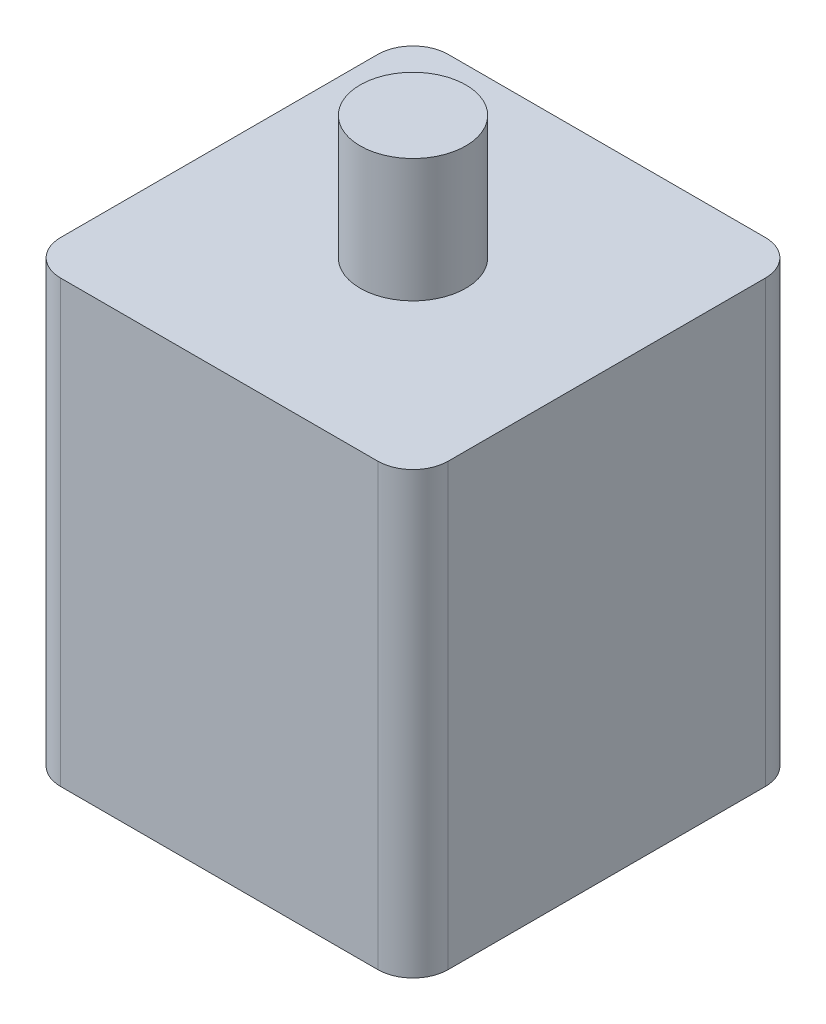
ISO-10303-21;
HEADER;
FILE_DESCRIPTION(('STEP AP214'),'2;1');
FILE_NAME('part.step','',(''),(''),'','','');
FILE_SCHEMA(('AUTOMOTIVE_DESIGN { 1 0 10303 214 1 1 1 1 }'));
ENDSEC;
DATA;
#1=APPLICATION_CONTEXT('core data for automotive mechanical design processes');
#2=APPLICATION_PROTOCOL_DEFINITION('international standard','automotive_design',2000,#1);
#3=PRODUCT_CONTEXT('',#1,'mechanical');
#4=PRODUCT('Part','Part','',(#3));
#5=PRODUCT_RELATED_PRODUCT_CATEGORY('part','',(#4));
#6=PRODUCT_DEFINITION_FORMATION('','',#4);
#7=PRODUCT_DEFINITION_CONTEXT('part definition',#1,'design');
#8=PRODUCT_DEFINITION('design','',#6,#7);
#9=PRODUCT_DEFINITION_SHAPE('','',#8);
#10=(LENGTH_UNIT() NAMED_UNIT(*) SI_UNIT(.MILLI.,.METRE.));
#11=(NAMED_UNIT(*) PLANE_ANGLE_UNIT() SI_UNIT($,.RADIAN.));
#12=(NAMED_UNIT(*) SI_UNIT($,.STERADIAN.) SOLID_ANGLE_UNIT());
#13=UNCERTAINTY_MEASURE_WITH_UNIT(LENGTH_MEASURE(1.E-05),#10,'distance_accuracy_value','');
#14=(GEOMETRIC_REPRESENTATION_CONTEXT(3) GLOBAL_UNCERTAINTY_ASSIGNED_CONTEXT((#13)) GLOBAL_UNIT_ASSIGNED_CONTEXT((#10,
#11,#12)) REPRESENTATION_CONTEXT('',''));
#15=CARTESIAN_POINT('',(0.,0.,0.));
#16=DIRECTION('',(0.,0.,1.));
#17=DIRECTION('',(1.,0.,0.));
#18=AXIS2_PLACEMENT_3D('',#15,#16,#17);
#19=CARTESIAN_POINT('',(-9.,25.,-9.));
#20=DIRECTION('',(0.,-1.,0.));
#21=DIRECTION('',(0.,0.,-1.));
#22=AXIS2_PLACEMENT_3D('',#19,#20,#21);
#23=CYLINDRICAL_SURFACE('',#22,2.);
#24=CARTESIAN_POINT('',(-9.,0.,-9.));
#25=DIRECTION('',(0.,1.,0.));
#26=DIRECTION('',(0.,0.,1.));
#27=AXIS2_PLACEMENT_3D('',#24,#25,#26);
#28=CIRCLE('',#27,2.);
#29=CARTESIAN_POINT('',(-11.,0.,-8.99999999999999));
#30=VERTEX_POINT('',#29);
#31=CARTESIAN_POINT('',(-8.99999999999999,0.,-11.));
#32=VERTEX_POINT('',#31);
#33=EDGE_CURVE('E129',#30,#32,#28,.F.);
#34=ORIENTED_EDGE('',*,*,#33,.F.);
#35=DIRECTION('',(0.,-1.,0.));
#36=VECTOR('',#35,1.);
#37=CARTESIAN_POINT('',(-11.,25.,-8.99999999999999));
#38=LINE('',#37,#36);
#39=CARTESIAN_POINT('',(-11.,25.,-8.99999999999999));
#40=VERTEX_POINT('',#39);
#41=EDGE_CURVE('E37',#40,#30,#38,.T.);
#42=ORIENTED_EDGE('',*,*,#41,.F.);
#43=CARTESIAN_POINT('',(-9.,25.,-9.));
#44=DIRECTION('',(0.,1.,0.));
#45=DIRECTION('',(0.,0.,1.));
#46=AXIS2_PLACEMENT_3D('',#43,#44,#45);
#47=CIRCLE('',#46,2.);
#48=CARTESIAN_POINT('',(-8.99999999999999,25.,-11.));
#49=VERTEX_POINT('',#48);
#50=EDGE_CURVE('E148',#40,#49,#47,.F.);
#51=ORIENTED_EDGE('',*,*,#50,.T.);
#52=DIRECTION('',(0.,-1.,0.));
#53=VECTOR('',#52,1.);
#54=CARTESIAN_POINT('',(-8.99999999999999,25.,-11.));
#55=LINE('',#54,#53);
#56=EDGE_CURVE('E51',#49,#32,#55,.T.);
#57=ORIENTED_EDGE('',*,*,#56,.T.);
#58=EDGE_LOOP('',(#34,#42,#51,#57));
#59=FACE_BOUND('',#58,.T.);
#60=ADVANCED_FACE('F34',(#59),#23,.T.);
#61=CARTESIAN_POINT('',(-11.,25.,0.));
#62=DIRECTION('',(-1.,0.,0.));
#63=DIRECTION('',(0.,0.,1.));
#64=AXIS2_PLACEMENT_3D('',#61,#62,#63);
#65=PLANE('',#64);
#66=DIRECTION('',(0.,0.,-1.));
#67=VECTOR('',#66,1.);
#68=CARTESIAN_POINT('',(-11.,0.,0.));
#69=LINE('',#68,#67);
#70=CARTESIAN_POINT('',(-11.,0.,8.99999999999998));
#71=VERTEX_POINT('',#70);
#72=EDGE_CURVE('E131',#71,#30,#69,.T.);
#73=ORIENTED_EDGE('',*,*,#72,.F.);
#74=DIRECTION('',(0.,-1.,0.));
#75=VECTOR('',#74,1.);
#76=CARTESIAN_POINT('',(-11.,25.,8.99999999999998));
#77=LINE('',#76,#75);
#78=CARTESIAN_POINT('',(-11.,25.,8.99999999999998));
#79=VERTEX_POINT('',#78);
#80=EDGE_CURVE('E156',#79,#71,#77,.T.);
#81=ORIENTED_EDGE('',*,*,#80,.F.);
#82=DIRECTION('',(0.,0.,-1.));
#83=VECTOR('',#82,1.);
#84=CARTESIAN_POINT('',(-11.,25.,0.));
#85=LINE('',#84,#83);
#86=EDGE_CURVE('E165',#79,#40,#85,.T.);
#87=ORIENTED_EDGE('',*,*,#86,.T.);
#88=ORIENTED_EDGE('',*,*,#41,.T.);
#89=EDGE_LOOP('',(#73,#81,#87,#88));
#90=FACE_BOUND('',#89,.T.);
#91=ADVANCED_FACE('F163',(#90),#65,.T.);
#92=CARTESIAN_POINT('',(-9.,25.,9.));
#93=DIRECTION('',(0.,-1.,0.));
#94=DIRECTION('',(0.,0.,-1.));
#95=AXIS2_PLACEMENT_3D('',#92,#93,#94);
#96=CYLINDRICAL_SURFACE('',#95,2.);
#97=CARTESIAN_POINT('',(-9.,0.,9.));
#98=DIRECTION('',(0.,1.,0.));
#99=DIRECTION('',(0.,0.,1.));
#100=AXIS2_PLACEMENT_3D('',#97,#98,#99);
#101=CIRCLE('',#100,2.);
#102=CARTESIAN_POINT('',(-8.99999999999999,0.,11.));
#103=VERTEX_POINT('',#102);
#104=EDGE_CURVE('E135',#103,#71,#101,.F.);
#105=ORIENTED_EDGE('',*,*,#104,.F.);
#106=DIRECTION('',(0.,-1.,0.));
#107=VECTOR('',#106,1.);
#108=CARTESIAN_POINT('',(-8.99999999999999,25.,11.));
#109=LINE('',#108,#107);
#110=CARTESIAN_POINT('',(-8.99999999999999,25.,11.));
#111=VERTEX_POINT('',#110);
#112=EDGE_CURVE('E155',#111,#103,#109,.T.);
#113=ORIENTED_EDGE('',*,*,#112,.F.);
#114=CARTESIAN_POINT('',(-9.,25.,9.));
#115=DIRECTION('',(0.,1.,0.));
#116=DIRECTION('',(0.,0.,1.));
#117=AXIS2_PLACEMENT_3D('',#114,#115,#116);
#118=CIRCLE('',#117,2.);
#119=EDGE_CURVE('E173',#111,#79,#118,.F.);
#120=ORIENTED_EDGE('',*,*,#119,.T.);
#121=ORIENTED_EDGE('',*,*,#80,.T.);
#122=EDGE_LOOP('',(#105,#113,#120,#121));
#123=FACE_BOUND('',#122,.T.);
#124=ADVANCED_FACE('F170',(#123),#96,.T.);
#125=CARTESIAN_POINT('',(0.,25.,11.));
#126=DIRECTION('',(0.,0.,-1.));
#127=DIRECTION('',(-1.,0.,0.));
#128=AXIS2_PLACEMENT_3D('',#125,#126,#127);
#129=PLANE('',#128);
#130=DIRECTION('',(1.,0.,0.));
#131=VECTOR('',#130,1.);
#132=CARTESIAN_POINT('',(0.,0.,11.));
#133=LINE('',#132,#131);
#134=CARTESIAN_POINT('',(8.99999999999999,0.,11.));
#135=VERTEX_POINT('',#134);
#136=EDGE_CURVE('E138',#103,#135,#133,.T.);
#137=ORIENTED_EDGE('',*,*,#136,.T.);
#138=DIRECTION('',(0.,-1.,0.));
#139=VECTOR('',#138,1.);
#140=CARTESIAN_POINT('',(8.99999999999999,25.,11.));
#141=LINE('',#140,#139);
#142=CARTESIAN_POINT('',(8.99999999999999,25.,11.));
#143=VERTEX_POINT('',#142);
#144=EDGE_CURVE('E152',#143,#135,#141,.T.);
#145=ORIENTED_EDGE('',*,*,#144,.F.);
#146=DIRECTION('',(1.,0.,0.));
#147=VECTOR('',#146,1.);
#148=CARTESIAN_POINT('',(0.,25.,11.));
#149=LINE('',#148,#147);
#150=EDGE_CURVE('E176',#111,#143,#149,.T.);
#151=ORIENTED_EDGE('',*,*,#150,.F.);
#152=ORIENTED_EDGE('',*,*,#112,.T.);
#153=EDGE_LOOP('',(#137,#145,#151,#152));
#154=FACE_BOUND('',#153,.T.);
#155=ADVANCED_FACE('F177',(#154),#129,.F.);
#156=CARTESIAN_POINT('',(9.,25.,9.));
#157=DIRECTION('',(0.,-1.,0.));
#158=DIRECTION('',(0.,0.,-1.));
#159=AXIS2_PLACEMENT_3D('',#156,#157,#158);
#160=CYLINDRICAL_SURFACE('',#159,2.);
#161=CARTESIAN_POINT('',(9.,0.,9.));
#162=DIRECTION('',(0.,1.,0.));
#163=DIRECTION('',(0.,0.,1.));
#164=AXIS2_PLACEMENT_3D('',#161,#162,#163);
#165=CIRCLE('',#164,2.);
#166=CARTESIAN_POINT('',(11.,0.,8.99999999999998));
#167=VERTEX_POINT('',#166);
#168=EDGE_CURVE('E140',#135,#167,#165,.T.);
#169=ORIENTED_EDGE('',*,*,#168,.T.);
#170=DIRECTION('',(0.,-1.,0.));
#171=VECTOR('',#170,1.);
#172=CARTESIAN_POINT('',(11.,25.,8.99999999999998));
#173=LINE('',#172,#171);
#174=CARTESIAN_POINT('',(11.,25.,8.99999999999998));
#175=VERTEX_POINT('',#174);
#176=EDGE_CURVE('E121',#175,#167,#173,.T.);
#177=ORIENTED_EDGE('',*,*,#176,.F.);
#178=CARTESIAN_POINT('',(9.,25.,9.));
#179=DIRECTION('',(0.,1.,0.));
#180=DIRECTION('',(0.,0.,1.));
#181=AXIS2_PLACEMENT_3D('',#178,#179,#180);
#182=CIRCLE('',#181,2.);
#183=EDGE_CURVE('E109',#143,#175,#182,.T.);
#184=ORIENTED_EDGE('',*,*,#183,.F.);
#185=ORIENTED_EDGE('',*,*,#144,.T.);
#186=EDGE_LOOP('',(#169,#177,#184,#185));
#187=FACE_BOUND('',#186,.T.);
#188=ADVANCED_FACE('F214',(#187),#160,.T.);
#189=CARTESIAN_POINT('',(11.,25.,0.));
#190=DIRECTION('',(-1.,0.,0.));
#191=DIRECTION('',(0.,0.,1.));
#192=AXIS2_PLACEMENT_3D('',#189,#190,#191);
#193=PLANE('',#192);
#194=DIRECTION('',(0.,0.,-1.));
#195=VECTOR('',#194,1.);
#196=CARTESIAN_POINT('',(11.,0.,0.));
#197=LINE('',#196,#195);
#198=CARTESIAN_POINT('',(11.,0.,-8.99999999999999));
#199=VERTEX_POINT('',#198);
#200=EDGE_CURVE('E118',#167,#199,#197,.T.);
#201=ORIENTED_EDGE('',*,*,#200,.T.);
#202=DIRECTION('',(0.,-1.,0.));
#203=VECTOR('',#202,1.);
#204=CARTESIAN_POINT('',(11.,25.,-8.99999999999999));
#205=LINE('',#204,#203);
#206=CARTESIAN_POINT('',(11.,25.,-8.99999999999999));
#207=VERTEX_POINT('',#206);
#208=EDGE_CURVE('E115',#207,#199,#205,.T.);
#209=ORIENTED_EDGE('',*,*,#208,.F.);
#210=DIRECTION('',(0.,0.,-1.));
#211=VECTOR('',#210,1.);
#212=CARTESIAN_POINT('',(11.,25.,0.));
#213=LINE('',#212,#211);
#214=EDGE_CURVE('E102',#175,#207,#213,.T.);
#215=ORIENTED_EDGE('',*,*,#214,.F.);
#216=ORIENTED_EDGE('',*,*,#176,.T.);
#217=EDGE_LOOP('',(#201,#209,#215,#216));
#218=FACE_BOUND('',#217,.T.);
#219=ADVANCED_FACE('F116',(#218),#193,.F.);
#220=CARTESIAN_POINT('',(9.,25.,-9.));
#221=DIRECTION('',(0.,-1.,0.));
#222=DIRECTION('',(0.,0.,-1.));
#223=AXIS2_PLACEMENT_3D('',#220,#221,#222);
#224=CYLINDRICAL_SURFACE('',#223,2.);
#225=CARTESIAN_POINT('',(9.,0.,-9.));
#226=DIRECTION('',(0.,1.,0.));
#227=DIRECTION('',(0.,0.,1.));
#228=AXIS2_PLACEMENT_3D('',#225,#226,#227);
#229=CIRCLE('',#228,2.);
#230=CARTESIAN_POINT('',(8.99999999999999,0.,-11.));
#231=VERTEX_POINT('',#230);
#232=EDGE_CURVE('E143',#231,#199,#229,.F.);
#233=ORIENTED_EDGE('',*,*,#232,.F.);
#234=DIRECTION('',(0.,-1.,0.));
#235=VECTOR('',#234,1.);
#236=CARTESIAN_POINT('',(8.99999999999999,25.,-11.));
#237=LINE('',#236,#235);
#238=CARTESIAN_POINT('',(8.99999999999999,25.,-11.));
#239=VERTEX_POINT('',#238);
#240=EDGE_CURVE('E77',#239,#231,#237,.T.);
#241=ORIENTED_EDGE('',*,*,#240,.F.);
#242=CARTESIAN_POINT('',(9.,25.,-9.));
#243=DIRECTION('',(0.,1.,0.));
#244=DIRECTION('',(0.,0.,1.));
#245=AXIS2_PLACEMENT_3D('',#242,#243,#244);
#246=CIRCLE('',#245,2.);
#247=EDGE_CURVE('E107',#239,#207,#246,.F.);
#248=ORIENTED_EDGE('',*,*,#247,.T.);
#249=ORIENTED_EDGE('',*,*,#208,.T.);
#250=EDGE_LOOP('',(#233,#241,#248,#249));
#251=FACE_BOUND('',#250,.T.);
#252=ADVANCED_FACE('F123',(#251),#224,.T.);
#253=CARTESIAN_POINT('',(0.,25.,-11.));
#254=DIRECTION('',(0.,0.,-1.));
#255=DIRECTION('',(-1.,0.,0.));
#256=AXIS2_PLACEMENT_3D('',#253,#254,#255);
#257=PLANE('',#256);
#258=DIRECTION('',(1.,0.,0.));
#259=VECTOR('',#258,1.);
#260=CARTESIAN_POINT('',(0.,0.,-11.));
#261=LINE('',#260,#259);
#262=EDGE_CURVE('E145',#32,#231,#261,.T.);
#263=ORIENTED_EDGE('',*,*,#262,.F.);
#264=ORIENTED_EDGE('',*,*,#56,.F.);
#265=DIRECTION('',(1.,0.,0.));
#266=VECTOR('',#265,1.);
#267=CARTESIAN_POINT('',(0.,25.,-11.));
#268=LINE('',#267,#266);
#269=EDGE_CURVE('E124',#49,#239,#268,.T.);
#270=ORIENTED_EDGE('',*,*,#269,.T.);
#271=ORIENTED_EDGE('',*,*,#240,.T.);
#272=EDGE_LOOP('',(#263,#264,#270,#271));
#273=FACE_BOUND('',#272,.T.);
#274=ADVANCED_FACE('F195',(#273),#257,.T.);
#275=CARTESIAN_POINT('',(0.,25.,0.));
#276=DIRECTION('',(0.,1.,0.));
#277=DIRECTION('',(0.,0.,1.));
#278=AXIS2_PLACEMENT_3D('',#275,#276,#277);
#279=PLANE('',#278);
#280=CARTESIAN_POINT('',(0.,25.,0.));
#281=DIRECTION('',(0.,1.,0.));
#282=DIRECTION('',(0.,0.,1.));
#283=AXIS2_PLACEMENT_3D('',#280,#281,#282);
#284=CIRCLE('',#283,3.);
#285=CARTESIAN_POINT('',(0.,25.,3.));
#286=VERTEX_POINT('',#285);
#287=EDGE_CURVE('E11',#286,#286,#284,.T.);
#288=ORIENTED_EDGE('',*,*,#287,.F.);
#289=EDGE_LOOP('',(#288));
#290=FACE_BOUND('',#289,.T.);
#291=ORIENTED_EDGE('',*,*,#50,.F.);
#292=ORIENTED_EDGE('',*,*,#86,.F.);
#293=ORIENTED_EDGE('',*,*,#119,.F.);
#294=ORIENTED_EDGE('',*,*,#150,.T.);
#295=ORIENTED_EDGE('',*,*,#183,.T.);
#296=ORIENTED_EDGE('',*,*,#214,.T.);
#297=ORIENTED_EDGE('',*,*,#247,.F.);
#298=ORIENTED_EDGE('',*,*,#269,.F.);
#299=EDGE_LOOP('',(#291,#292,#293,#294,#295,#296,#297,#298));
#300=FACE_BOUND('',#299,.T.);
#301=ADVANCED_FACE('F104',(#290,#300),#279,.T.);
#302=CARTESIAN_POINT('',(0.,0.,0.));
#303=DIRECTION('',(0.,1.,0.));
#304=DIRECTION('',(0.,0.,1.));
#305=AXIS2_PLACEMENT_3D('',#302,#303,#304);
#306=PLANE('',#305);
#307=ORIENTED_EDGE('',*,*,#33,.T.);
#308=ORIENTED_EDGE('',*,*,#262,.T.);
#309=ORIENTED_EDGE('',*,*,#232,.T.);
#310=ORIENTED_EDGE('',*,*,#200,.F.);
#311=ORIENTED_EDGE('',*,*,#168,.F.);
#312=ORIENTED_EDGE('',*,*,#136,.F.);
#313=ORIENTED_EDGE('',*,*,#104,.T.);
#314=ORIENTED_EDGE('',*,*,#72,.T.);
#315=EDGE_LOOP('',(#307,#308,#309,#310,#311,#312,#313,#314));
#316=FACE_BOUND('',#315,.T.);
#317=ADVANCED_FACE('F167',(#316),#306,.F.);
#318=CARTESIAN_POINT('',(0.,32.,0.));
#319=DIRECTION('',(0.,-1.,0.));
#320=DIRECTION('',(0.,0.,-1.));
#321=AXIS2_PLACEMENT_3D('',#318,#319,#320);
#322=CYLINDRICAL_SURFACE('',#321,3.);
#323=CARTESIAN_POINT('',(0.,32.,0.));
#324=DIRECTION('',(0.,1.,0.));
#325=DIRECTION('',(0.,0.,1.));
#326=AXIS2_PLACEMENT_3D('',#323,#324,#325);
#327=CIRCLE('',#326,3.);
#328=CARTESIAN_POINT('',(0.,32.,3.));
#329=VERTEX_POINT('',#328);
#330=EDGE_CURVE('E132',#329,#329,#327,.T.);
#331=ORIENTED_EDGE('',*,*,#330,.F.);
#332=EDGE_LOOP('',(#331));
#333=FACE_BOUND('',#332,.T.);
#334=ORIENTED_EDGE('',*,*,#287,.T.);
#335=EDGE_LOOP('',(#334));
#336=FACE_BOUND('',#335,.T.);
#337=ADVANCED_FACE('F188',(#333,#336),#322,.T.);
#338=CARTESIAN_POINT('',(0.,32.,0.));
#339=DIRECTION('',(0.,1.,0.));
#340=DIRECTION('',(0.,0.,1.));
#341=AXIS2_PLACEMENT_3D('',#338,#339,#340);
#342=PLANE('',#341);
#343=ORIENTED_EDGE('',*,*,#330,.T.);
#344=EDGE_LOOP('',(#343));
#345=FACE_BOUND('',#344,.T.);
#346=ADVANCED_FACE('F186',(#345),#342,.T.);
#347=CLOSED_SHELL('',(#60,#91,#124,#155,#188,#219,#252,#274,#301,#317,#337,#346));
#348=MANIFOLD_SOLID_BREP('B2',#347);
#349=ADVANCED_BREP_SHAPE_REPRESENTATION('',(#18,#348),#14);
#350=SHAPE_DEFINITION_REPRESENTATION(#9,#349);
ENDSEC;
END-ISO-10303-21;
